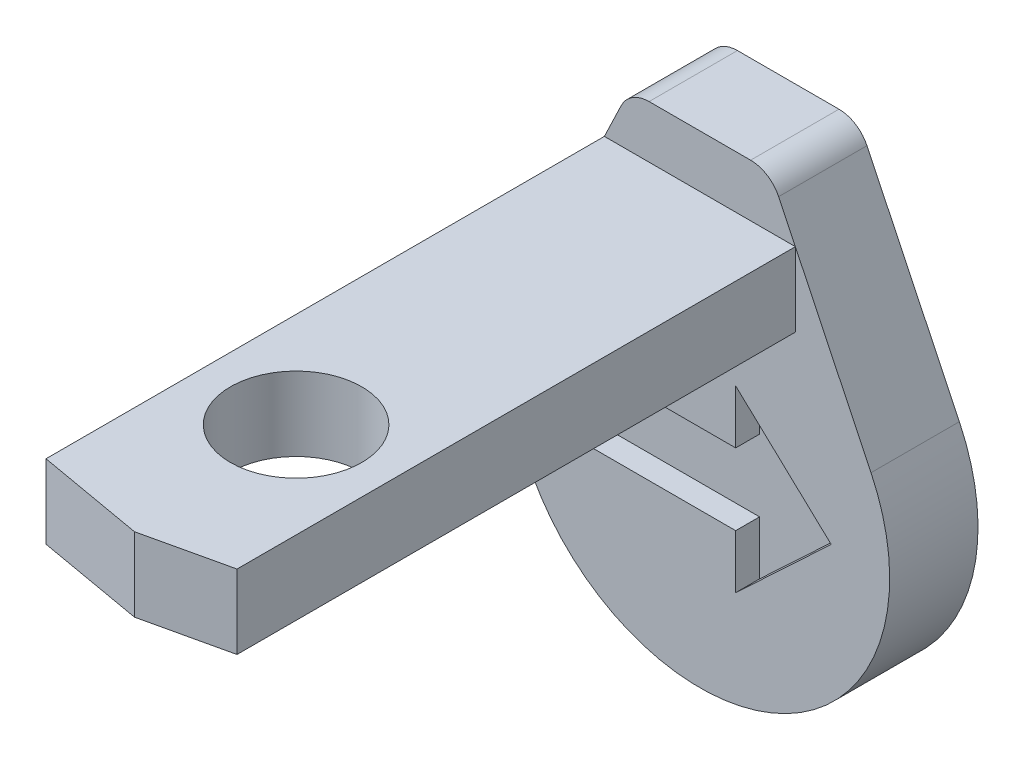
ISO-10303-21;
HEADER;
FILE_DESCRIPTION(('STEP AP214'),'2;1');
FILE_NAME('part.step','',(''),(''),'','','');
FILE_SCHEMA(('AUTOMOTIVE_DESIGN { 1 0 10303 214 1 1 1 1 }'));
ENDSEC;
DATA;
#1=APPLICATION_CONTEXT('core data for automotive mechanical design processes');
#2=APPLICATION_PROTOCOL_DEFINITION('international standard','automotive_design',2000,#1);
#3=PRODUCT_CONTEXT('',#1,'mechanical');
#4=PRODUCT('Part','Part','',(#3));
#5=PRODUCT_RELATED_PRODUCT_CATEGORY('part','',(#4));
#6=PRODUCT_DEFINITION_FORMATION('','',#4);
#7=PRODUCT_DEFINITION_CONTEXT('part definition',#1,'design');
#8=PRODUCT_DEFINITION('design','',#6,#7);
#9=PRODUCT_DEFINITION_SHAPE('','',#8);
#10=(LENGTH_UNIT() NAMED_UNIT(*) SI_UNIT(.MILLI.,.METRE.));
#11=(NAMED_UNIT(*) PLANE_ANGLE_UNIT() SI_UNIT($,.RADIAN.));
#12=(NAMED_UNIT(*) SI_UNIT($,.STERADIAN.) SOLID_ANGLE_UNIT());
#13=UNCERTAINTY_MEASURE_WITH_UNIT(LENGTH_MEASURE(1.E-05),#10,'distance_accuracy_value','');
#14=(GEOMETRIC_REPRESENTATION_CONTEXT(3) GLOBAL_UNCERTAINTY_ASSIGNED_CONTEXT((#13)) GLOBAL_UNIT_ASSIGNED_CONTEXT((#10,
#11,#12)) REPRESENTATION_CONTEXT('',''));
#15=CARTESIAN_POINT('',(0.,0.,0.));
#16=DIRECTION('',(0.,0.,1.));
#17=DIRECTION('',(1.,0.,0.));
#18=AXIS2_PLACEMENT_3D('',#15,#16,#17);
#19=CARTESIAN_POINT('',(29.4208944797667,-35.0531465050097,37.));
#20=DIRECTION('',(0.,0.,-1.));
#21=DIRECTION('',(-0.866025403784443,0.499999999999992,0.));
#22=AXIS2_PLACEMENT_3D('',#19,#20,#21);
#23=PLANE('',#22);
#24=DIRECTION('',(-1.,0.,0.));
#25=VECTOR('',#24,1.);
#26=CARTESIAN_POINT('',(40.,78.,37.0000000000001));
#27=LINE('',#26,#25);
#28=CARTESIAN_POINT('',(39.9914457911384,78.,37.0000000000001));
#29=VERTEX_POINT('',#28);
#30=CARTESIAN_POINT('',(-39.9914457911384,78.,37.0000000000001));
#31=VERTEX_POINT('',#30);
#32=EDGE_CURVE('E11',#29,#31,#27,.T.);
#33=ORIENTED_EDGE('',*,*,#32,.F.);
#34=DIRECTION('',(-0.432206183170999,0.901774814035498,0.));
#35=VECTOR('',#34,1.);
#36=CARTESIAN_POINT('',(62.9216630806065,30.1573424047418,37.0000000000001));
#37=LINE('',#36,#35);
#38=CARTESIAN_POINT('',(32.9849471040766,92.6186803812229,37.0000000000002));
#39=VERTEX_POINT('',#38);
#40=EDGE_CURVE('E285',#29,#39,#37,.T.);
#41=ORIENTED_EDGE('',*,*,#40,.T.);
#42=CARTESIAN_POINT('',(21.2618745216152,87.,37.0000000000002));
#43=DIRECTION('',(0.,0.,-1.));
#44=DIRECTION('',(0.,1.,0.));
#45=AXIS2_PLACEMENT_3D('',#42,#43,#44);
#46=CIRCLE('',#45,13.);
#47=CARTESIAN_POINT('',(21.2618745216152,99.9999999999999,37.0000000000002));
#48=VERTEX_POINT('',#47);
#49=EDGE_CURVE('E326',#48,#39,#46,.T.);
#50=ORIENTED_EDGE('',*,*,#49,.F.);
#51=DIRECTION('',(-1.,0.,0.));
#52=VECTOR('',#51,1.);
#53=CARTESIAN_POINT('',(-1.16489850376178E-13,99.9999999999999,37.0000000000003));
#54=LINE('',#53,#52);
#55=CARTESIAN_POINT('',(-21.2618745216151,99.9999999999999,37.0000000000002));
#56=VERTEX_POINT('',#55);
#57=EDGE_CURVE('E296',#48,#56,#54,.T.);
#58=ORIENTED_EDGE('',*,*,#57,.T.);
#59=CARTESIAN_POINT('',(-21.2618745216151,87.,37.0000000000002));
#60=DIRECTION('',(0.,0.,-1.));
#61=DIRECTION('',(0.,1.,0.));
#62=AXIS2_PLACEMENT_3D('',#59,#60,#61);
#63=CIRCLE('',#62,13.);
#64=CARTESIAN_POINT('',(-32.9849471040766,92.6186803812229,37.0000000000002));
#65=VERTEX_POINT('',#64);
#66=EDGE_CURVE('E292',#65,#56,#63,.T.);
#67=ORIENTED_EDGE('',*,*,#66,.F.);
#68=DIRECTION('',(0.432206183170999,0.901774814035498,0.));
#69=VECTOR('',#68,1.);
#70=CARTESIAN_POINT('',(-62.9216630806065,30.1573424047417,37.0000000000001));
#71=LINE('',#70,#69);
#72=EDGE_CURVE('E288',#31,#65,#71,.T.);
#73=ORIENTED_EDGE('',*,*,#72,.F.);
#74=EDGE_LOOP('',(#33,#41,#50,#58,#67,#73));
#75=FACE_BOUND('',#74,.T.);
#76=ADVANCED_FACE('F35',(#75),#23,.F.);
#77=DIRECTION('',(-0.729537204140085,0.68394112888133,0.));
#78=VECTOR('',#77,1.);
#79=CARTESIAN_POINT('',(55.,-22.5000000000001,37.0000000000001));
#80=LINE('',#79,#78);
#81=CARTESIAN_POINT('',(55.,-22.5000000000001,37.));
#82=VERTEX_POINT('',#81);
#83=CARTESIAN_POINT('',(15.,14.9999999999999,37.0000000000001));
#84=VERTEX_POINT('',#83);
#85=EDGE_CURVE('E217',#82,#84,#80,.T.);
#86=ORIENTED_EDGE('',*,*,#85,.F.);
#87=DIRECTION('',(0.729537204140085,0.68394112888133,0.));
#88=VECTOR('',#87,1.);
#89=CARTESIAN_POINT('',(15.,-60.,37.0000000000001));
#90=LINE('',#89,#88);
#91=CARTESIAN_POINT('',(15.,-60.,37.0000000000001));
#92=VERTEX_POINT('',#91);
#93=EDGE_CURVE('E54',#92,#82,#90,.T.);
#94=ORIENTED_EDGE('',*,*,#93,.F.);
#95=DIRECTION('',(0.,-1.,0.));
#96=VECTOR('',#95,1.);
#97=CARTESIAN_POINT('',(15.,-37.5,37.0000000000001));
#98=LINE('',#97,#96);
#99=CARTESIAN_POINT('',(15.,-37.5,37.0000000000001));
#100=VERTEX_POINT('',#99);
#101=EDGE_CURVE('E198',#100,#92,#98,.T.);
#102=ORIENTED_EDGE('',*,*,#101,.F.);
#103=DIRECTION('',(1.,0.,0.));
#104=VECTOR('',#103,1.);
#105=CARTESIAN_POINT('',(-50.,-37.5,37.0000000000001));
#106=LINE('',#105,#104);
#107=CARTESIAN_POINT('',(-50.,-37.5,37.0000000000001));
#108=VERTEX_POINT('',#107);
#109=EDGE_CURVE('E201',#108,#100,#106,.T.);
#110=ORIENTED_EDGE('',*,*,#109,.F.);
#111=DIRECTION('',(0.,-1.,0.));
#112=VECTOR('',#111,1.);
#113=CARTESIAN_POINT('',(-50.,-7.50000000000006,37.0000000000001));
#114=LINE('',#113,#112);
#115=CARTESIAN_POINT('',(-50.,-7.50000000000006,37.0000000000001));
#116=VERTEX_POINT('',#115);
#117=EDGE_CURVE('E225',#116,#108,#114,.T.);
#118=ORIENTED_EDGE('',*,*,#117,.F.);
#119=DIRECTION('',(-1.,0.,0.));
#120=VECTOR('',#119,1.);
#121=CARTESIAN_POINT('',(15.,-7.50000000000005,37.0000000000001));
#122=LINE('',#121,#120);
#123=CARTESIAN_POINT('',(15.,-7.50000000000005,37.0000000000001));
#124=VERTEX_POINT('',#123);
#125=EDGE_CURVE('E222',#124,#116,#122,.T.);
#126=ORIENTED_EDGE('',*,*,#125,.F.);
#127=DIRECTION('',(0.,-1.,0.));
#128=VECTOR('',#127,1.);
#129=CARTESIAN_POINT('',(15.,14.9999999999999,37.0000000000001));
#130=LINE('',#129,#128);
#131=EDGE_CURVE('E219',#84,#124,#130,.T.);
#132=ORIENTED_EDGE('',*,*,#131,.F.);
#133=EDGE_LOOP('',(#86,#94,#102,#110,#118,#126,#132));
#134=FACE_BOUND('',#133,.T.);
#135=DIRECTION('',(0.,1.,0.));
#136=VECTOR('',#135,1.);
#137=CARTESIAN_POINT('',(40.,47.,37.0000000000001));
#138=LINE('',#137,#136);
#139=CARTESIAN_POINT('',(40.,47.,37.0000000000001));
#140=VERTEX_POINT('',#139);
#141=CARTESIAN_POINT('',(40.,77.982152106088,37.0000000000001));
#142=VERTEX_POINT('',#141);
#143=EDGE_CURVE('E62',#140,#142,#138,.T.);
#144=ORIENTED_EDGE('',*,*,#143,.F.);
#145=DIRECTION('',(1.,0.,0.));
#146=VECTOR('',#145,1.);
#147=CARTESIAN_POINT('',(-40.,47.,37.0000000000001));
#148=LINE('',#147,#146);
#149=CARTESIAN_POINT('',(-40.,47.,37.0000000000001));
#150=VERTEX_POINT('',#149);
#151=EDGE_CURVE('E264',#150,#140,#148,.T.);
#152=ORIENTED_EDGE('',*,*,#151,.F.);
#153=DIRECTION('',(0.,-1.,0.));
#154=VECTOR('',#153,1.);
#155=CARTESIAN_POINT('',(-40.,78.,37.0000000000001));
#156=LINE('',#155,#154);
#157=CARTESIAN_POINT('',(-40.,77.9821521060879,37.0000000000001));
#158=VERTEX_POINT('',#157);
#159=EDGE_CURVE('E44',#158,#150,#156,.T.);
#160=ORIENTED_EDGE('',*,*,#159,.F.);
#161=CARTESIAN_POINT('',(-71.6910977158221,11.8603915620944,37.0000000000002));
#162=VERTEX_POINT('',#161);
#163=EDGE_CURVE('E289',#162,#158,#71,.T.);
#164=ORIENTED_EDGE('',*,*,#163,.F.);
#165=CARTESIAN_POINT('',(0.,-22.5,37.0000000000001));
#166=DIRECTION('',(0.,0.,-1.));
#167=DIRECTION('',(0.,1.,0.));
#168=AXIS2_PLACEMENT_3D('',#165,#166,#167);
#169=CIRCLE('',#168,79.5);
#170=CARTESIAN_POINT('',(71.6910977158221,11.8603915620944,37.0000000000001));
#171=VERTEX_POINT('',#170);
#172=EDGE_CURVE('E283',#171,#162,#169,.T.);
#173=ORIENTED_EDGE('',*,*,#172,.F.);
#174=EDGE_CURVE('E281',#171,#142,#37,.T.);
#175=ORIENTED_EDGE('',*,*,#174,.T.);
#176=EDGE_LOOP('',(#144,#152,#160,#164,#173,#175));
#177=FACE_BOUND('',#176,.T.);
#178=ADVANCED_FACE('F361',(#134,#177),#23,.F.);
#179=CARTESIAN_POINT('',(0.,0.,0.));
#180=DIRECTION('',(0.,0.,1.));
#181=DIRECTION('',(1.,0.,0.));
#182=AXIS2_PLACEMENT_3D('',#179,#180,#181);
#183=PLANE('',#182);
#184=DIRECTION('',(1.,0.,0.));
#185=VECTOR('',#184,1.);
#186=CARTESIAN_POINT('',(0.,99.9999999999999,0.));
#187=LINE('',#186,#185);
#188=CARTESIAN_POINT('',(-21.2618745216151,99.9999999999999,0.));
#189=VERTEX_POINT('',#188);
#190=CARTESIAN_POINT('',(21.2618745216152,99.9999999999999,0.));
#191=VERTEX_POINT('',#190);
#192=EDGE_CURVE('E262',#189,#191,#187,.T.);
#193=ORIENTED_EDGE('',*,*,#192,.T.);
#194=CARTESIAN_POINT('',(21.2618745216152,87.,0.));
#195=DIRECTION('',(0.,0.,1.));
#196=DIRECTION('',(1.,0.,0.));
#197=AXIS2_PLACEMENT_3D('',#194,#195,#196);
#198=CIRCLE('',#197,13.);
#199=CARTESIAN_POINT('',(32.9849471040766,92.6186803812229,0.));
#200=VERTEX_POINT('',#199);
#201=EDGE_CURVE('E312',#200,#191,#198,.T.);
#202=ORIENTED_EDGE('',*,*,#201,.F.);
#203=DIRECTION('',(0.432206183170999,-0.901774814035498,0.));
#204=VECTOR('',#203,1.);
#205=CARTESIAN_POINT('',(62.9216630806066,30.1573424047414,0.));
#206=LINE('',#205,#204);
#207=CARTESIAN_POINT('',(71.6910977158221,11.8603915620944,0.));
#208=VERTEX_POINT('',#207);
#209=EDGE_CURVE('E309',#200,#208,#206,.T.);
#210=ORIENTED_EDGE('',*,*,#209,.T.);
#211=CARTESIAN_POINT('',(0.,-22.5,0.));
#212=DIRECTION('',(0.,0.,1.));
#213=DIRECTION('',(1.,0.,0.));
#214=AXIS2_PLACEMENT_3D('',#211,#212,#213);
#215=CIRCLE('',#214,79.5);
#216=CARTESIAN_POINT('',(-71.6910977158221,11.8603915620944,0.));
#217=VERTEX_POINT('',#216);
#218=EDGE_CURVE('E306',#217,#208,#215,.T.);
#219=ORIENTED_EDGE('',*,*,#218,.F.);
#220=DIRECTION('',(-0.432206183170999,-0.901774814035498,0.));
#221=VECTOR('',#220,1.);
#222=CARTESIAN_POINT('',(-62.9216630806066,30.1573424047414,0.));
#223=LINE('',#222,#221);
#224=CARTESIAN_POINT('',(-32.9849471040766,92.6186803812229,0.));
#225=VERTEX_POINT('',#224);
#226=EDGE_CURVE('E303',#225,#217,#223,.T.);
#227=ORIENTED_EDGE('',*,*,#226,.F.);
#228=CARTESIAN_POINT('',(-21.2618745216151,87.,0.));
#229=DIRECTION('',(0.,0.,1.));
#230=DIRECTION('',(1.,0.,0.));
#231=AXIS2_PLACEMENT_3D('',#228,#229,#230);
#232=CIRCLE('',#231,13.);
#233=EDGE_CURVE('E300',#189,#225,#232,.T.);
#234=ORIENTED_EDGE('',*,*,#233,.F.);
#235=EDGE_LOOP('',(#193,#202,#210,#219,#227,#234));
#236=FACE_BOUND('',#235,.T.);
#237=ADVANCED_FACE('F381',(#236),#183,.F.);
#238=CARTESIAN_POINT('',(21.2618745216152,87.,294.070029369431));
#239=DIRECTION('',(0.,0.,-1.));
#240=DIRECTION('',(-1.,0.,0.));
#241=AXIS2_PLACEMENT_3D('',#238,#239,#240);
#242=CYLINDRICAL_SURFACE('',#241,13.);
#243=DIRECTION('',(0.,0.,-1.));
#244=VECTOR('',#243,1.);
#245=CARTESIAN_POINT('',(21.2618745216152,99.9999999999999,294.070029369431));
#246=LINE('',#245,#244);
#247=EDGE_CURVE('E315',#48,#191,#246,.T.);
#248=ORIENTED_EDGE('',*,*,#247,.F.);
#249=ORIENTED_EDGE('',*,*,#49,.T.);
#250=DIRECTION('',(0.,0.,-1.));
#251=VECTOR('',#250,1.);
#252=CARTESIAN_POINT('',(32.9849471040766,92.6186803812229,294.070029369431));
#253=LINE('',#252,#251);
#254=EDGE_CURVE('E317',#39,#200,#253,.T.);
#255=ORIENTED_EDGE('',*,*,#254,.T.);
#256=ORIENTED_EDGE('',*,*,#201,.T.);
#257=EDGE_LOOP('',(#248,#249,#255,#256));
#258=FACE_BOUND('',#257,.T.);
#259=ADVANCED_FACE('F388',(#258),#242,.T.);
#260=CARTESIAN_POINT('',(62.9216630806066,30.1573424047414,294.070029369431));
#261=DIRECTION('',(0.901774814035498,0.432206183170999,0.));
#262=DIRECTION('',(-0.432206183170999,0.901774814035498,0.));
#263=AXIS2_PLACEMENT_3D('',#260,#261,#262);
#264=PLANE('',#263);
#265=ORIENTED_EDGE('',*,*,#174,.F.);
#266=DIRECTION('',(0.,0.,-1.));
#267=VECTOR('',#266,1.);
#268=CARTESIAN_POINT('',(71.6910977158221,11.8603915620944,294.070029369431));
#269=LINE('',#268,#267);
#270=EDGE_CURVE('E319',#171,#208,#269,.T.);
#271=ORIENTED_EDGE('',*,*,#270,.T.);
#272=ORIENTED_EDGE('',*,*,#209,.F.);
#273=ORIENTED_EDGE('',*,*,#254,.F.);
#274=ORIENTED_EDGE('',*,*,#40,.F.);
#275=EDGE_CURVE('E284',#142,#29,#37,.T.);
#276=ORIENTED_EDGE('',*,*,#275,.F.);
#277=EDGE_LOOP('',(#265,#271,#272,#273,#274,#276));
#278=FACE_BOUND('',#277,.T.);
#279=ADVANCED_FACE('F387',(#278),#264,.T.);
#280=CARTESIAN_POINT('',(0.,-22.5,294.070029369431));
#281=DIRECTION('',(0.,0.,-1.));
#282=DIRECTION('',(-1.,0.,0.));
#283=AXIS2_PLACEMENT_3D('',#280,#281,#282);
#284=CYLINDRICAL_SURFACE('',#283,79.5);
#285=ORIENTED_EDGE('',*,*,#270,.F.);
#286=ORIENTED_EDGE('',*,*,#172,.T.);
#287=DIRECTION('',(0.,0.,-1.));
#288=VECTOR('',#287,1.);
#289=CARTESIAN_POINT('',(-71.6910977158221,11.8603915620944,294.070029369431));
#290=LINE('',#289,#288);
#291=EDGE_CURVE('E321',#162,#217,#290,.T.);
#292=ORIENTED_EDGE('',*,*,#291,.T.);
#293=ORIENTED_EDGE('',*,*,#218,.T.);
#294=EDGE_LOOP('',(#285,#286,#292,#293));
#295=FACE_BOUND('',#294,.T.);
#296=ADVANCED_FACE('F386',(#295),#284,.T.);
#297=CARTESIAN_POINT('',(-62.9216630806066,30.1573424047414,294.070029369431));
#298=DIRECTION('',(0.901774814035498,-0.432206183170999,0.));
#299=DIRECTION('',(0.432206183170999,0.901774814035498,0.));
#300=AXIS2_PLACEMENT_3D('',#297,#298,#299);
#301=PLANE('',#300);
#302=ORIENTED_EDGE('',*,*,#291,.F.);
#303=ORIENTED_EDGE('',*,*,#163,.T.);
#304=EDGE_CURVE('E293',#158,#31,#71,.T.);
#305=ORIENTED_EDGE('',*,*,#304,.T.);
#306=ORIENTED_EDGE('',*,*,#72,.T.);
#307=DIRECTION('',(0.,0.,-1.));
#308=VECTOR('',#307,1.);
#309=CARTESIAN_POINT('',(-32.9849471040766,92.6186803812229,294.070029369431));
#310=LINE('',#309,#308);
#311=EDGE_CURVE('E323',#65,#225,#310,.T.);
#312=ORIENTED_EDGE('',*,*,#311,.T.);
#313=ORIENTED_EDGE('',*,*,#226,.T.);
#314=EDGE_LOOP('',(#302,#303,#305,#306,#312,#313));
#315=FACE_BOUND('',#314,.T.);
#316=ADVANCED_FACE('F366',(#315),#301,.F.);
#317=CARTESIAN_POINT('',(-21.2618745216151,87.,294.070029369431));
#318=DIRECTION('',(0.,0.,-1.));
#319=DIRECTION('',(-1.,0.,0.));
#320=AXIS2_PLACEMENT_3D('',#317,#318,#319);
#321=CYLINDRICAL_SURFACE('',#320,13.);
#322=ORIENTED_EDGE('',*,*,#311,.F.);
#323=ORIENTED_EDGE('',*,*,#66,.T.);
#324=DIRECTION('',(0.,0.,-1.));
#325=VECTOR('',#324,1.);
#326=CARTESIAN_POINT('',(-21.2618745216151,99.9999999999999,294.070029369431));
#327=LINE('',#326,#325);
#328=EDGE_CURVE('E325',#56,#189,#327,.T.);
#329=ORIENTED_EDGE('',*,*,#328,.T.);
#330=ORIENTED_EDGE('',*,*,#233,.T.);
#331=EDGE_LOOP('',(#322,#323,#329,#330));
#332=FACE_BOUND('',#331,.T.);
#333=ADVANCED_FACE('F375',(#332),#321,.T.);
#334=CARTESIAN_POINT('',(0.,99.9999999999999,294.070029369431));
#335=DIRECTION('',(0.,1.,0.));
#336=DIRECTION('',(0.,0.,1.));
#337=AXIS2_PLACEMENT_3D('',#334,#335,#336);
#338=PLANE('',#337);
#339=ORIENTED_EDGE('',*,*,#57,.F.);
#340=ORIENTED_EDGE('',*,*,#247,.T.);
#341=ORIENTED_EDGE('',*,*,#192,.F.);
#342=ORIENTED_EDGE('',*,*,#328,.F.);
#343=EDGE_LOOP('',(#339,#340,#341,#342));
#344=FACE_BOUND('',#343,.T.);
#345=ADVANCED_FACE('F37',(#344),#338,.T.);
#346=CARTESIAN_POINT('',(0.,0.,37.0000000000001));
#347=DIRECTION('',(0.,0.,1.));
#348=DIRECTION('',(1.,0.,0.));
#349=AXIS2_PLACEMENT_3D('',#346,#347,#348);
#350=PLANE('',#349);
#351=CARTESIAN_POINT('',(40.,78.,37.0000000000001));
#352=VERTEX_POINT('',#351);
#353=EDGE_CURVE('E263',#142,#352,#138,.T.);
#354=ORIENTED_EDGE('',*,*,#353,.F.);
#355=ORIENTED_EDGE('',*,*,#275,.T.);
#356=EDGE_CURVE('E46',#352,#29,#27,.T.);
#357=ORIENTED_EDGE('',*,*,#356,.F.);
#358=EDGE_LOOP('',(#354,#355,#357));
#359=FACE_BOUND('',#358,.T.);
#360=ADVANCED_FACE('F337',(#359),#350,.F.);
#361=CARTESIAN_POINT('',(40.,78.,335.446270315207));
#362=DIRECTION('',(0.,-1.,0.));
#363=DIRECTION('',(0.,0.,-1.));
#364=AXIS2_PLACEMENT_3D('',#361,#362,#363);
#365=PLANE('',#364);
#366=CARTESIAN_POINT('',(0.,78.,206.1));
#367=DIRECTION('',(0.,1.,0.));
#368=DIRECTION('',(0.,0.,1.));
#369=AXIS2_PLACEMENT_3D('',#366,#367,#368);
#370=CIRCLE('',#369,27.5);
#371=CARTESIAN_POINT('',(0.,78.,233.6));
#372=VERTEX_POINT('',#371);
#373=EDGE_CURVE('E204',#372,#372,#370,.T.);
#374=ORIENTED_EDGE('',*,*,#373,.F.);
#375=EDGE_LOOP('',(#374));
#376=FACE_BOUND('',#375,.T.);
#377=DIRECTION('',(0.,0.,-1.));
#378=VECTOR('',#377,1.);
#379=CARTESIAN_POINT('',(-40.,78.,335.446270315207));
#380=LINE('',#379,#378);
#381=CARTESIAN_POINT('',(-40.,78.,270.85));
#382=VERTEX_POINT('',#381);
#383=CARTESIAN_POINT('',(-40.,78.,37.0000000000001));
#384=VERTEX_POINT('',#383);
#385=EDGE_CURVE('E271',#382,#384,#380,.T.);
#386=ORIENTED_EDGE('',*,*,#385,.F.);
#387=DIRECTION('',(0.984807753012209,0.,0.173648177666923));
#388=VECTOR('',#387,1.);
#389=CARTESIAN_POINT('',(-40.,78.,270.85));
#390=LINE('',#389,#388);
#391=CARTESIAN_POINT('',(5.,78.,278.784714131881));
#392=VERTEX_POINT('',#391);
#393=EDGE_CURVE('E232',#382,#392,#390,.T.);
#394=ORIENTED_EDGE('',*,*,#393,.T.);
#395=DIRECTION('',(0.975252133779284,0.,-0.221095625372719));
#396=VECTOR('',#395,1.);
#397=CARTESIAN_POINT('',(5.,78.,278.784714131881));
#398=LINE('',#397,#396);
#399=CARTESIAN_POINT('',(40.,78.,270.85));
#400=VERTEX_POINT('',#399);
#401=EDGE_CURVE('E249',#392,#400,#398,.T.);
#402=ORIENTED_EDGE('',*,*,#401,.T.);
#403=DIRECTION('',(0.,0.,-1.));
#404=VECTOR('',#403,1.);
#405=CARTESIAN_POINT('',(40.,78.,335.446270315207));
#406=LINE('',#405,#404);
#407=EDGE_CURVE('E260',#400,#352,#406,.T.);
#408=ORIENTED_EDGE('',*,*,#407,.T.);
#409=ORIENTED_EDGE('',*,*,#356,.T.);
#410=ORIENTED_EDGE('',*,*,#32,.T.);
#411=EDGE_CURVE('E47',#31,#384,#27,.T.);
#412=ORIENTED_EDGE('',*,*,#411,.T.);
#413=EDGE_LOOP('',(#386,#394,#402,#408,#409,#410,#412));
#414=FACE_BOUND('',#413,.T.);
#415=ADVANCED_FACE('F341',(#376,#414),#365,.F.);
#416=CARTESIAN_POINT('',(-40.,78.,335.446270315207));
#417=DIRECTION('',(1.,0.,0.));
#418=DIRECTION('',(0.,0.,-1.));
#419=AXIS2_PLACEMENT_3D('',#416,#417,#418);
#420=PLANE('',#419);
#421=DIRECTION('',(0.,0.,-1.));
#422=VECTOR('',#421,1.);
#423=CARTESIAN_POINT('',(-40.,47.,335.446270315207));
#424=LINE('',#423,#422);
#425=CARTESIAN_POINT('',(-40.,47.,270.85));
#426=VERTEX_POINT('',#425);
#427=EDGE_CURVE('E268',#426,#150,#424,.T.);
#428=ORIENTED_EDGE('',*,*,#427,.F.);
#429=DIRECTION('',(0.,1.,0.));
#430=VECTOR('',#429,1.);
#431=CARTESIAN_POINT('',(-40.,-38.1400702815449,270.85));
#432=LINE('',#431,#430);
#433=EDGE_CURVE('E246',#426,#382,#432,.T.);
#434=ORIENTED_EDGE('',*,*,#433,.T.);
#435=ORIENTED_EDGE('',*,*,#385,.T.);
#436=EDGE_CURVE('E269',#384,#158,#156,.T.);
#437=ORIENTED_EDGE('',*,*,#436,.T.);
#438=ORIENTED_EDGE('',*,*,#159,.T.);
#439=EDGE_LOOP('',(#428,#434,#435,#437,#438));
#440=FACE_BOUND('',#439,.T.);
#441=ADVANCED_FACE('F358',(#440),#420,.F.);
#442=CARTESIAN_POINT('',(-40.,47.,335.446270315207));
#443=DIRECTION('',(0.,1.,0.));
#444=DIRECTION('',(0.,0.,1.));
#445=AXIS2_PLACEMENT_3D('',#442,#443,#444);
#446=PLANE('',#445);
#447=CARTESIAN_POINT('',(0.,47.,206.1));
#448=DIRECTION('',(0.,1.,0.));
#449=DIRECTION('',(0.,0.,1.));
#450=AXIS2_PLACEMENT_3D('',#447,#448,#449);
#451=CIRCLE('',#450,27.5);
#452=CARTESIAN_POINT('',(0.,47.,233.6));
#453=VERTEX_POINT('',#452);
#454=EDGE_CURVE('E39',#453,#453,#451,.T.);
#455=ORIENTED_EDGE('',*,*,#454,.T.);
#456=EDGE_LOOP('',(#455));
#457=FACE_BOUND('',#456,.T.);
#458=DIRECTION('',(0.,0.,-1.));
#459=VECTOR('',#458,1.);
#460=CARTESIAN_POINT('',(40.,47.,335.446270315207));
#461=LINE('',#460,#459);
#462=CARTESIAN_POINT('',(40.,47.,270.85));
#463=VERTEX_POINT('',#462);
#464=EDGE_CURVE('E267',#463,#140,#461,.T.);
#465=ORIENTED_EDGE('',*,*,#464,.F.);
#466=DIRECTION('',(-0.975252133779284,0.,0.221095625372719));
#467=VECTOR('',#466,1.);
#468=CARTESIAN_POINT('',(5.,47.,278.784714131881));
#469=LINE('',#468,#467);
#470=CARTESIAN_POINT('',(5.,47.,278.784714131881));
#471=VERTEX_POINT('',#470);
#472=EDGE_CURVE('E245',#463,#471,#469,.T.);
#473=ORIENTED_EDGE('',*,*,#472,.T.);
#474=DIRECTION('',(-0.984807753012209,0.,-0.173648177666923));
#475=VECTOR('',#474,1.);
#476=CARTESIAN_POINT('',(-40.,47.,270.85));
#477=LINE('',#476,#475);
#478=EDGE_CURVE('E242',#471,#426,#477,.T.);
#479=ORIENTED_EDGE('',*,*,#478,.T.);
#480=ORIENTED_EDGE('',*,*,#427,.T.);
#481=ORIENTED_EDGE('',*,*,#151,.T.);
#482=EDGE_LOOP('',(#465,#473,#479,#480,#481));
#483=FACE_BOUND('',#482,.T.);
#484=ADVANCED_FACE('F352',(#457,#483),#446,.F.);
#485=CARTESIAN_POINT('',(40.,47.,335.446270315207));
#486=DIRECTION('',(-1.,0.,0.));
#487=DIRECTION('',(0.,0.,1.));
#488=AXIS2_PLACEMENT_3D('',#485,#486,#487);
#489=PLANE('',#488);
#490=ORIENTED_EDGE('',*,*,#407,.F.);
#491=DIRECTION('',(0.,1.,0.));
#492=VECTOR('',#491,1.);
#493=CARTESIAN_POINT('',(40.,-38.1400702815449,270.85));
#494=LINE('',#493,#492);
#495=EDGE_CURVE('E255',#463,#400,#494,.T.);
#496=ORIENTED_EDGE('',*,*,#495,.F.);
#497=ORIENTED_EDGE('',*,*,#464,.T.);
#498=ORIENTED_EDGE('',*,*,#143,.T.);
#499=ORIENTED_EDGE('',*,*,#353,.T.);
#500=EDGE_LOOP('',(#490,#496,#497,#498,#499));
#501=FACE_BOUND('',#500,.T.);
#502=ADVANCED_FACE('F345',(#501),#489,.F.);
#503=ORIENTED_EDGE('',*,*,#304,.F.);
#504=ORIENTED_EDGE('',*,*,#436,.F.);
#505=ORIENTED_EDGE('',*,*,#411,.F.);
#506=EDGE_LOOP('',(#503,#504,#505));
#507=FACE_BOUND('',#506,.T.);
#508=ADVANCED_FACE('F369',(#507),#350,.F.);
#509=CARTESIAN_POINT('',(-40.,-38.1400702815449,270.85));
#510=DIRECTION('',(-0.173648177666923,0.,0.984807753012209));
#511=DIRECTION('',(0.984807753012209,0.,0.173648177666923));
#512=AXIS2_PLACEMENT_3D('',#509,#510,#511);
#513=PLANE('',#512);
#514=ORIENTED_EDGE('',*,*,#478,.F.);
#515=DIRECTION('',(0.,1.,0.));
#516=VECTOR('',#515,1.);
#517=CARTESIAN_POINT('',(5.,-38.1400702815449,278.784714131881));
#518=LINE('',#517,#516);
#519=EDGE_CURVE('E252',#471,#392,#518,.T.);
#520=ORIENTED_EDGE('',*,*,#519,.T.);
#521=ORIENTED_EDGE('',*,*,#393,.F.);
#522=ORIENTED_EDGE('',*,*,#433,.F.);
#523=EDGE_LOOP('',(#514,#520,#521,#522));
#524=FACE_BOUND('',#523,.T.);
#525=ADVANCED_FACE('F355',(#524),#513,.T.);
#526=CARTESIAN_POINT('',(5.,-38.1400702815449,278.784714131881));
#527=DIRECTION('',(0.221095625372719,0.,0.975252133779284));
#528=DIRECTION('',(0.975252133779284,0.,-0.221095625372719));
#529=AXIS2_PLACEMENT_3D('',#526,#527,#528);
#530=PLANE('',#529);
#531=ORIENTED_EDGE('',*,*,#472,.F.);
#532=ORIENTED_EDGE('',*,*,#495,.T.);
#533=ORIENTED_EDGE('',*,*,#401,.F.);
#534=ORIENTED_EDGE('',*,*,#519,.F.);
#535=EDGE_LOOP('',(#531,#532,#533,#534));
#536=FACE_BOUND('',#535,.T.);
#537=ADVANCED_FACE('F348',(#536),#530,.T.);
#538=CARTESIAN_POINT('',(15.,-60.,27.0000000000001));
#539=DIRECTION('',(0.68394112888133,-0.729537204140085,0.));
#540=DIRECTION('',(0.729537204140085,0.68394112888133,0.));
#541=AXIS2_PLACEMENT_3D('',#538,#539,#540);
#542=PLANE('',#541);
#543=ORIENTED_EDGE('',*,*,#93,.T.);
#544=DIRECTION('',(0.,0.,1.));
#545=VECTOR('',#544,1.);
#546=CARTESIAN_POINT('',(55.,-22.5000000000001,27.0000000000001));
#547=LINE('',#546,#545);
#548=CARTESIAN_POINT('',(55.,-22.5000000000001,27.0000000000001));
#549=VERTEX_POINT('',#548);
#550=EDGE_CURVE('E175',#549,#82,#547,.T.);
#551=ORIENTED_EDGE('',*,*,#550,.F.);
#552=DIRECTION('',(0.729537204140085,0.68394112888133,0.));
#553=VECTOR('',#552,1.);
#554=CARTESIAN_POINT('',(15.,-60.,27.0000000000001));
#555=LINE('',#554,#553);
#556=CARTESIAN_POINT('',(15.,-60.,27.0000000000001));
#557=VERTEX_POINT('',#556);
#558=EDGE_CURVE('E179',#557,#549,#555,.T.);
#559=ORIENTED_EDGE('',*,*,#558,.F.);
#560=DIRECTION('',(0.,0.,1.));
#561=VECTOR('',#560,1.);
#562=CARTESIAN_POINT('',(15.,-60.,27.0000000000001));
#563=LINE('',#562,#561);
#564=EDGE_CURVE('E230',#557,#92,#563,.T.);
#565=ORIENTED_EDGE('',*,*,#564,.T.);
#566=EDGE_LOOP('',(#543,#551,#559,#565));
#567=FACE_BOUND('',#566,.T.);
#568=ADVANCED_FACE('F177',(#567),#542,.F.);
#569=CARTESIAN_POINT('',(15.,-37.5,27.0000000000001));
#570=DIRECTION('',(-1.,0.,0.));
#571=DIRECTION('',(0.,0.,1.));
#572=AXIS2_PLACEMENT_3D('',#569,#570,#571);
#573=PLANE('',#572);
#574=ORIENTED_EDGE('',*,*,#101,.T.);
#575=ORIENTED_EDGE('',*,*,#564,.F.);
#576=DIRECTION('',(0.,-1.,0.));
#577=VECTOR('',#576,1.);
#578=CARTESIAN_POINT('',(15.,-37.5,27.0000000000001));
#579=LINE('',#578,#577);
#580=CARTESIAN_POINT('',(15.,-37.5,27.0000000000001));
#581=VERTEX_POINT('',#580);
#582=EDGE_CURVE('E185',#581,#557,#579,.T.);
#583=ORIENTED_EDGE('',*,*,#582,.F.);
#584=DIRECTION('',(0.,0.,1.));
#585=VECTOR('',#584,1.);
#586=CARTESIAN_POINT('',(15.,-37.5,27.0000000000001));
#587=LINE('',#586,#585);
#588=EDGE_CURVE('E233',#581,#100,#587,.T.);
#589=ORIENTED_EDGE('',*,*,#588,.T.);
#590=EDGE_LOOP('',(#574,#575,#583,#589));
#591=FACE_BOUND('',#590,.T.);
#592=ADVANCED_FACE('F468',(#591),#573,.F.);
#593=CARTESIAN_POINT('',(-50.,-37.5,27.0000000000001));
#594=DIRECTION('',(0.,-1.,0.));
#595=DIRECTION('',(0.,0.,-1.));
#596=AXIS2_PLACEMENT_3D('',#593,#594,#595);
#597=PLANE('',#596);
#598=ORIENTED_EDGE('',*,*,#109,.T.);
#599=ORIENTED_EDGE('',*,*,#588,.F.);
#600=DIRECTION('',(1.,0.,0.));
#601=VECTOR('',#600,1.);
#602=CARTESIAN_POINT('',(-50.,-37.5,27.0000000000001));
#603=LINE('',#602,#601);
#604=CARTESIAN_POINT('',(-50.,-37.5,27.0000000000001));
#605=VERTEX_POINT('',#604);
#606=EDGE_CURVE('E213',#605,#581,#603,.T.);
#607=ORIENTED_EDGE('',*,*,#606,.F.);
#608=DIRECTION('',(0.,0.,1.));
#609=VECTOR('',#608,1.);
#610=CARTESIAN_POINT('',(-50.,-37.5,27.0000000000001));
#611=LINE('',#610,#609);
#612=EDGE_CURVE('E235',#605,#108,#611,.T.);
#613=ORIENTED_EDGE('',*,*,#612,.T.);
#614=EDGE_LOOP('',(#598,#599,#607,#613));
#615=FACE_BOUND('',#614,.T.);
#616=ADVANCED_FACE('F477',(#615),#597,.F.);
#617=CARTESIAN_POINT('',(-50.,-7.50000000000006,27.0000000000001));
#618=DIRECTION('',(-1.,0.,0.));
#619=DIRECTION('',(0.,-1.,0.));
#620=AXIS2_PLACEMENT_3D('',#617,#618,#619);
#621=PLANE('',#620);
#622=ORIENTED_EDGE('',*,*,#117,.T.);
#623=ORIENTED_EDGE('',*,*,#612,.F.);
#624=DIRECTION('',(0.,-1.,0.));
#625=VECTOR('',#624,1.);
#626=CARTESIAN_POINT('',(-50.,-7.50000000000006,27.0000000000001));
#627=LINE('',#626,#625);
#628=CARTESIAN_POINT('',(-50.,-7.50000000000006,27.0000000000001));
#629=VERTEX_POINT('',#628);
#630=EDGE_CURVE('E210',#629,#605,#627,.T.);
#631=ORIENTED_EDGE('',*,*,#630,.F.);
#632=DIRECTION('',(0.,0.,1.));
#633=VECTOR('',#632,1.);
#634=CARTESIAN_POINT('',(-50.,-7.50000000000006,27.0000000000001));
#635=LINE('',#634,#633);
#636=EDGE_CURVE('E237',#629,#116,#635,.T.);
#637=ORIENTED_EDGE('',*,*,#636,.T.);
#638=EDGE_LOOP('',(#622,#623,#631,#637));
#639=FACE_BOUND('',#638,.T.);
#640=ADVANCED_FACE('F487',(#639),#621,.F.);
#641=CARTESIAN_POINT('',(15.,-7.50000000000005,27.0000000000001));
#642=DIRECTION('',(0.,1.,0.));
#643=DIRECTION('',(-1.,0.,0.));
#644=AXIS2_PLACEMENT_3D('',#641,#642,#643);
#645=PLANE('',#644);
#646=ORIENTED_EDGE('',*,*,#125,.T.);
#647=ORIENTED_EDGE('',*,*,#636,.F.);
#648=DIRECTION('',(-1.,0.,0.));
#649=VECTOR('',#648,1.);
#650=CARTESIAN_POINT('',(15.,-7.50000000000005,27.0000000000001));
#651=LINE('',#650,#649);
#652=CARTESIAN_POINT('',(15.,-7.50000000000005,27.0000000000001));
#653=VERTEX_POINT('',#652);
#654=EDGE_CURVE('E207',#653,#629,#651,.T.);
#655=ORIENTED_EDGE('',*,*,#654,.F.);
#656=DIRECTION('',(0.,0.,1.));
#657=VECTOR('',#656,1.);
#658=CARTESIAN_POINT('',(15.,-7.50000000000005,27.0000000000001));
#659=LINE('',#658,#657);
#660=EDGE_CURVE('E239',#653,#124,#659,.T.);
#661=ORIENTED_EDGE('',*,*,#660,.T.);
#662=EDGE_LOOP('',(#646,#647,#655,#661));
#663=FACE_BOUND('',#662,.T.);
#664=ADVANCED_FACE('F497',(#663),#645,.F.);
#665=CARTESIAN_POINT('',(15.,14.9999999999999,27.0000000000001));
#666=DIRECTION('',(-1.,0.,0.));
#667=DIRECTION('',(0.,-1.,0.));
#668=AXIS2_PLACEMENT_3D('',#665,#666,#667);
#669=PLANE('',#668);
#670=ORIENTED_EDGE('',*,*,#131,.T.);
#671=ORIENTED_EDGE('',*,*,#660,.F.);
#672=DIRECTION('',(0.,-1.,0.));
#673=VECTOR('',#672,1.);
#674=CARTESIAN_POINT('',(15.,14.9999999999999,27.0000000000001));
#675=LINE('',#674,#673);
#676=CARTESIAN_POINT('',(15.,14.9999999999999,27.0000000000001));
#677=VERTEX_POINT('',#676);
#678=EDGE_CURVE('E193',#677,#653,#675,.T.);
#679=ORIENTED_EDGE('',*,*,#678,.F.);
#680=DIRECTION('',(0.,0.,1.));
#681=VECTOR('',#680,1.);
#682=CARTESIAN_POINT('',(15.,14.9999999999999,27.0000000000001));
#683=LINE('',#682,#681);
#684=EDGE_CURVE('E184',#677,#84,#683,.T.);
#685=ORIENTED_EDGE('',*,*,#684,.T.);
#686=EDGE_LOOP('',(#670,#671,#679,#685));
#687=FACE_BOUND('',#686,.T.);
#688=ADVANCED_FACE('F507',(#687),#669,.F.);
#689=CARTESIAN_POINT('',(55.,-22.5000000000001,27.0000000000001));
#690=DIRECTION('',(0.68394112888133,0.729537204140085,0.));
#691=DIRECTION('',(-0.729537204140085,0.68394112888133,0.));
#692=AXIS2_PLACEMENT_3D('',#689,#690,#691);
#693=PLANE('',#692);
#694=ORIENTED_EDGE('',*,*,#85,.T.);
#695=ORIENTED_EDGE('',*,*,#684,.F.);
#696=DIRECTION('',(-0.729537204140085,0.68394112888133,0.));
#697=VECTOR('',#696,1.);
#698=CARTESIAN_POINT('',(55.,-22.5000000000001,27.0000000000001));
#699=LINE('',#698,#697);
#700=EDGE_CURVE('E188',#549,#677,#699,.T.);
#701=ORIENTED_EDGE('',*,*,#700,.F.);
#702=ORIENTED_EDGE('',*,*,#550,.T.);
#703=EDGE_LOOP('',(#694,#695,#701,#702));
#704=FACE_BOUND('',#703,.T.);
#705=ADVANCED_FACE('F189',(#704),#693,.F.);
#706=CARTESIAN_POINT('',(0.,0.,27.0000000000001));
#707=DIRECTION('',(0.,0.,1.));
#708=DIRECTION('',(1.,0.,0.));
#709=AXIS2_PLACEMENT_3D('',#706,#707,#708);
#710=PLANE('',#709);
#711=ORIENTED_EDGE('',*,*,#558,.T.);
#712=ORIENTED_EDGE('',*,*,#700,.T.);
#713=ORIENTED_EDGE('',*,*,#678,.T.);
#714=ORIENTED_EDGE('',*,*,#654,.T.);
#715=ORIENTED_EDGE('',*,*,#630,.T.);
#716=ORIENTED_EDGE('',*,*,#606,.T.);
#717=ORIENTED_EDGE('',*,*,#582,.T.);
#718=EDGE_LOOP('',(#711,#712,#713,#714,#715,#716,#717));
#719=FACE_BOUND('',#718,.T.);
#720=ADVANCED_FACE('F195',(#719),#710,.T.);
#721=CARTESIAN_POINT('',(0.,-102.,206.1));
#722=DIRECTION('',(0.,1.,0.));
#723=DIRECTION('',(0.,0.,1.));
#724=AXIS2_PLACEMENT_3D('',#721,#722,#723);
#725=CYLINDRICAL_SURFACE('',#724,27.5);
#726=ORIENTED_EDGE('',*,*,#373,.T.);
#727=EDGE_LOOP('',(#726));
#728=FACE_BOUND('',#727,.T.);
#729=ORIENTED_EDGE('',*,*,#454,.F.);
#730=EDGE_LOOP('',(#729));
#731=FACE_BOUND('',#730,.T.);
#732=ADVANCED_FACE('F534',(#728,#731),#725,.F.);
#733=CLOSED_SHELL('',(#76,#178,#237,#259,#279,#296,#316,#333,#345,#360,#415,#441,#484,#502,#508,
#525,#537,#568,#592,#616,#640,#664,#688,#705,#720,#732));
#734=MANIFOLD_SOLID_BREP('B2',#733);
#735=ADVANCED_BREP_SHAPE_REPRESENTATION('',(#18,#734),#14);
#736=SHAPE_DEFINITION_REPRESENTATION(#9,#735);
ENDSEC;
END-ISO-10303-21;
